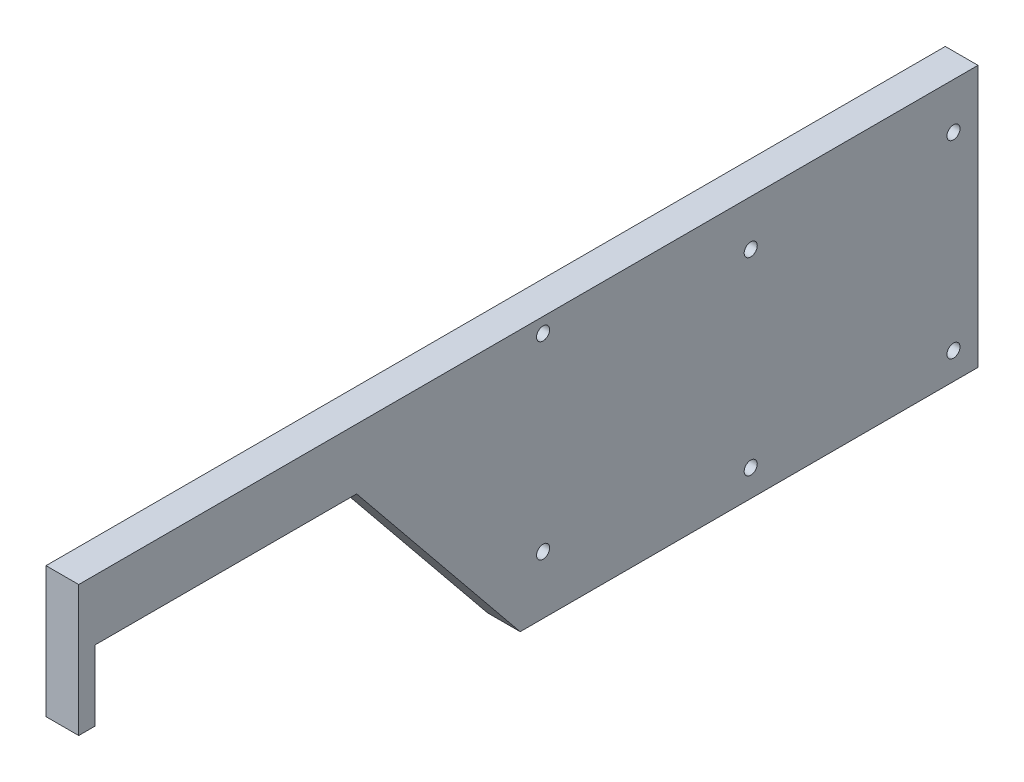
ISO-10303-21;
HEADER;
FILE_DESCRIPTION(('STEP AP214'),'2;1');
FILE_NAME('part.step','',(''),(''),'','','');
FILE_SCHEMA(('AUTOMOTIVE_DESIGN { 1 0 10303 214 1 1 1 1 }'));
ENDSEC;
DATA;
#1=APPLICATION_CONTEXT('core data for automotive mechanical design processes');
#2=APPLICATION_PROTOCOL_DEFINITION('international standard','automotive_design',2000,#1);
#3=PRODUCT_CONTEXT('',#1,'mechanical');
#4=PRODUCT('Part','Part','',(#3));
#5=PRODUCT_RELATED_PRODUCT_CATEGORY('part','',(#4));
#6=PRODUCT_DEFINITION_FORMATION('','',#4);
#7=PRODUCT_DEFINITION_CONTEXT('part definition',#1,'design');
#8=PRODUCT_DEFINITION('design','',#6,#7);
#9=PRODUCT_DEFINITION_SHAPE('','',#8);
#10=(LENGTH_UNIT() NAMED_UNIT(*) SI_UNIT(.MILLI.,.METRE.));
#11=(NAMED_UNIT(*) PLANE_ANGLE_UNIT() SI_UNIT($,.RADIAN.));
#12=(NAMED_UNIT(*) SI_UNIT($,.STERADIAN.) SOLID_ANGLE_UNIT());
#13=UNCERTAINTY_MEASURE_WITH_UNIT(LENGTH_MEASURE(1.E-05),#10,'distance_accuracy_value','');
#14=(GEOMETRIC_REPRESENTATION_CONTEXT(3) GLOBAL_UNCERTAINTY_ASSIGNED_CONTEXT((#13)) GLOBAL_UNIT_ASSIGNED_CONTEXT((#10,
#11,#12)) REPRESENTATION_CONTEXT('',''));
#15=CARTESIAN_POINT('',(0.,0.,0.));
#16=DIRECTION('',(0.,0.,1.));
#17=DIRECTION('',(1.,0.,0.));
#18=AXIS2_PLACEMENT_3D('',#15,#16,#17);
#19=CARTESIAN_POINT('',(10.,0.,0.));
#20=DIRECTION('',(-1.,0.,0.));
#21=DIRECTION('',(0.,0.,1.));
#22=AXIS2_PLACEMENT_3D('',#19,#20,#21);
#23=PLANE('',#22);
#24=DIRECTION('',(0.,0.,1.));
#25=VECTOR('',#24,1.);
#26=CARTESIAN_POINT('',(10.,29.25,43.));
#27=LINE('',#26,#25);
#28=CARTESIAN_POINT('',(10.,29.25,-232.));
#29=VERTEX_POINT('',#28);
#30=CARTESIAN_POINT('',(10.,29.25,43.));
#31=VERTEX_POINT('',#30);
#32=EDGE_CURVE('E168',#29,#31,#27,.T.);
#33=ORIENTED_EDGE('',*,*,#32,.T.);
#34=DIRECTION('',(0.,-1.,0.));
#35=VECTOR('',#34,1.);
#36=CARTESIAN_POINT('',(10.,-10.75,43.));
#37=LINE('',#36,#35);
#38=CARTESIAN_POINT('',(10.,-10.75,43.));
#39=VERTEX_POINT('',#38);
#40=EDGE_CURVE('E104',#31,#39,#37,.T.);
#41=ORIENTED_EDGE('',*,*,#40,.T.);
#42=DIRECTION('',(0.,0.,-1.));
#43=VECTOR('',#42,1.);
#44=CARTESIAN_POINT('',(10.,-10.75,38.));
#45=LINE('',#44,#43);
#46=CARTESIAN_POINT('',(10.,-10.75,38.));
#47=VERTEX_POINT('',#46);
#48=EDGE_CURVE('E189',#39,#47,#45,.T.);
#49=ORIENTED_EDGE('',*,*,#48,.T.);
#50=DIRECTION('',(0.,1.,0.));
#51=VECTOR('',#50,1.);
#52=CARTESIAN_POINT('',(10.,10.75,38.));
#53=LINE('',#52,#51);
#54=CARTESIAN_POINT('',(10.,10.75,38.));
#55=VERTEX_POINT('',#54);
#56=EDGE_CURVE('E203',#47,#55,#53,.T.);
#57=ORIENTED_EDGE('',*,*,#56,.T.);
#58=DIRECTION('',(0.,0.,-1.));
#59=VECTOR('',#58,1.);
#60=CARTESIAN_POINT('',(10.,10.75,-42.));
#61=LINE('',#60,#59);
#62=CARTESIAN_POINT('',(10.,10.75,-42.));
#63=VERTEX_POINT('',#62);
#64=EDGE_CURVE('E123',#55,#63,#61,.T.);
#65=ORIENTED_EDGE('',*,*,#64,.T.);
#66=DIRECTION('',(0.,-0.775921003990177,-0.63083008454486));
#67=VECTOR('',#66,1.);
#68=CARTESIAN_POINT('',(10.,-50.75,-92.));
#69=LINE('',#68,#67);
#70=CARTESIAN_POINT('',(10.,-50.75,-92.));
#71=VERTEX_POINT('',#70);
#72=EDGE_CURVE('E117',#63,#71,#69,.T.);
#73=ORIENTED_EDGE('',*,*,#72,.T.);
#74=DIRECTION('',(0.,0.,-1.));
#75=VECTOR('',#74,1.);
#76=CARTESIAN_POINT('',(10.,-50.75,-232.));
#77=LINE('',#76,#75);
#78=CARTESIAN_POINT('',(10.,-50.75,-232.));
#79=VERTEX_POINT('',#78);
#80=EDGE_CURVE('E121',#71,#79,#77,.T.);
#81=ORIENTED_EDGE('',*,*,#80,.T.);
#82=DIRECTION('',(0.,1.,0.));
#83=VECTOR('',#82,1.);
#84=CARTESIAN_POINT('',(10.,29.25,-232.));
#85=LINE('',#84,#83);
#86=EDGE_CURVE('E61',#79,#29,#85,.T.);
#87=ORIENTED_EDGE('',*,*,#86,.T.);
#88=EDGE_LOOP('',(#33,#41,#49,#57,#65,#73,#81,#87));
#89=FACE_BOUND('',#88,.T.);
#90=CARTESIAN_POINT('',(10.,24.75,-99.));
#91=DIRECTION('',(1.,0.,0.));
#92=DIRECTION('',(0.,0.,-1.));
#93=AXIS2_PLACEMENT_3D('',#90,#91,#92);
#94=CIRCLE('',#93,2.);
#95=CARTESIAN_POINT('',(10.,24.75,-101.));
#96=VERTEX_POINT('',#95);
#97=EDGE_CURVE('E150',#96,#96,#94,.T.);
#98=ORIENTED_EDGE('',*,*,#97,.F.);
#99=EDGE_LOOP('',(#98));
#100=FACE_BOUND('',#99,.T.);
#101=CARTESIAN_POINT('',(10.,-33.05,-99.));
#102=DIRECTION('',(1.,0.,0.));
#103=DIRECTION('',(0.,0.,-1.));
#104=AXIS2_PLACEMENT_3D('',#101,#102,#103);
#105=CIRCLE('',#104,2.);
#106=CARTESIAN_POINT('',(10.,-33.05,-101.));
#107=VERTEX_POINT('',#106);
#108=EDGE_CURVE('E217',#107,#107,#105,.T.);
#109=ORIENTED_EDGE('',*,*,#108,.F.);
#110=EDGE_LOOP('',(#109));
#111=FACE_BOUND('',#110,.T.);
#112=CARTESIAN_POINT('',(10.,15.25,-162.5));
#113=DIRECTION('',(1.,0.,0.));
#114=DIRECTION('',(0.,0.,-1.));
#115=AXIS2_PLACEMENT_3D('',#112,#113,#114);
#116=CIRCLE('',#115,2.);
#117=CARTESIAN_POINT('',(10.,15.25,-164.5));
#118=VERTEX_POINT('',#117);
#119=EDGE_CURVE('E225',#118,#118,#116,.T.);
#120=ORIENTED_EDGE('',*,*,#119,.F.);
#121=EDGE_LOOP('',(#120));
#122=FACE_BOUND('',#121,.T.);
#123=CARTESIAN_POINT('',(10.,15.25,-224.5));
#124=DIRECTION('',(1.,0.,0.));
#125=DIRECTION('',(0.,0.,-1.));
#126=AXIS2_PLACEMENT_3D('',#123,#124,#125);
#127=CIRCLE('',#126,2.);
#128=CARTESIAN_POINT('',(10.,15.25,-226.5));
#129=VERTEX_POINT('',#128);
#130=EDGE_CURVE('E233',#129,#129,#127,.T.);
#131=ORIENTED_EDGE('',*,*,#130,.F.);
#132=EDGE_LOOP('',(#131));
#133=FACE_BOUND('',#132,.T.);
#134=CARTESIAN_POINT('',(10.,-42.55,-162.5));
#135=DIRECTION('',(1.,0.,0.));
#136=DIRECTION('',(0.,0.,-1.));
#137=AXIS2_PLACEMENT_3D('',#134,#135,#136);
#138=CIRCLE('',#137,2.);
#139=CARTESIAN_POINT('',(10.,-42.55,-164.5));
#140=VERTEX_POINT('',#139);
#141=EDGE_CURVE('E241',#140,#140,#138,.T.);
#142=ORIENTED_EDGE('',*,*,#141,.F.);
#143=EDGE_LOOP('',(#142));
#144=FACE_BOUND('',#143,.T.);
#145=CARTESIAN_POINT('',(10.,-42.55,-224.5));
#146=DIRECTION('',(1.,0.,0.));
#147=DIRECTION('',(0.,0.,-1.));
#148=AXIS2_PLACEMENT_3D('',#145,#146,#147);
#149=CIRCLE('',#148,2.);
#150=CARTESIAN_POINT('',(10.,-42.55,-226.5));
#151=VERTEX_POINT('',#150);
#152=EDGE_CURVE('E249',#151,#151,#149,.T.);
#153=ORIENTED_EDGE('',*,*,#152,.F.);
#154=EDGE_LOOP('',(#153));
#155=FACE_BOUND('',#154,.T.);
#156=ADVANCED_FACE('F43',(#89,#100,#111,#122,#133,#144,#155),#23,.F.);
#157=CARTESIAN_POINT('',(0.,0.,0.));
#158=DIRECTION('',(-1.,0.,0.));
#159=DIRECTION('',(0.,0.,1.));
#160=AXIS2_PLACEMENT_3D('',#157,#158,#159);
#161=PLANE('',#160);
#162=CARTESIAN_POINT('',(0.,-42.55,-162.5));
#163=DIRECTION('',(1.,0.,0.));
#164=DIRECTION('',(0.,0.,-1.));
#165=AXIS2_PLACEMENT_3D('',#162,#163,#164);
#166=CIRCLE('',#165,2.);
#167=CARTESIAN_POINT('',(0.,-42.55,-164.5));
#168=VERTEX_POINT('',#167);
#169=EDGE_CURVE('E245',#168,#168,#166,.T.);
#170=ORIENTED_EDGE('',*,*,#169,.T.);
#171=EDGE_LOOP('',(#170));
#172=FACE_BOUND('',#171,.T.);
#173=CARTESIAN_POINT('',(0.,15.25,-162.5));
#174=DIRECTION('',(1.,0.,0.));
#175=DIRECTION('',(0.,0.,-1.));
#176=AXIS2_PLACEMENT_3D('',#173,#174,#175);
#177=CIRCLE('',#176,2.);
#178=CARTESIAN_POINT('',(0.,15.25,-164.5));
#179=VERTEX_POINT('',#178);
#180=EDGE_CURVE('E229',#179,#179,#177,.T.);
#181=ORIENTED_EDGE('',*,*,#180,.T.);
#182=EDGE_LOOP('',(#181));
#183=FACE_BOUND('',#182,.T.);
#184=CARTESIAN_POINT('',(0.,24.75,-99.));
#185=DIRECTION('',(1.,0.,0.));
#186=DIRECTION('',(0.,0.,-1.));
#187=AXIS2_PLACEMENT_3D('',#184,#185,#186);
#188=CIRCLE('',#187,2.);
#189=CARTESIAN_POINT('',(0.,24.75,-101.));
#190=VERTEX_POINT('',#189);
#191=EDGE_CURVE('E213',#190,#190,#188,.T.);
#192=ORIENTED_EDGE('',*,*,#191,.T.);
#193=EDGE_LOOP('',(#192));
#194=FACE_BOUND('',#193,.T.);
#195=DIRECTION('',(0.,0.,1.));
#196=VECTOR('',#195,1.);
#197=CARTESIAN_POINT('',(0.,29.25,43.));
#198=LINE('',#197,#196);
#199=CARTESIAN_POINT('',(0.,29.25,-232.));
#200=VERTEX_POINT('',#199);
#201=CARTESIAN_POINT('',(0.,29.25,43.));
#202=VERTEX_POINT('',#201);
#203=EDGE_CURVE('E145',#200,#202,#198,.T.);
#204=ORIENTED_EDGE('',*,*,#203,.F.);
#205=DIRECTION('',(0.,1.,0.));
#206=VECTOR('',#205,1.);
#207=CARTESIAN_POINT('',(0.,29.25,-232.));
#208=LINE('',#207,#206);
#209=CARTESIAN_POINT('',(0.,-50.75,-232.));
#210=VERTEX_POINT('',#209);
#211=EDGE_CURVE('E96',#210,#200,#208,.T.);
#212=ORIENTED_EDGE('',*,*,#211,.F.);
#213=DIRECTION('',(0.,0.,-1.));
#214=VECTOR('',#213,1.);
#215=CARTESIAN_POINT('',(0.,-50.75,-232.));
#216=LINE('',#215,#214);
#217=CARTESIAN_POINT('',(0.,-50.75,-92.));
#218=VERTEX_POINT('',#217);
#219=EDGE_CURVE('E90',#218,#210,#216,.T.);
#220=ORIENTED_EDGE('',*,*,#219,.F.);
#221=DIRECTION('',(0.,-0.775921003990177,-0.63083008454486));
#222=VECTOR('',#221,1.);
#223=CARTESIAN_POINT('',(0.,-50.75,-92.));
#224=LINE('',#223,#222);
#225=CARTESIAN_POINT('',(0.,10.75,-42.));
#226=VERTEX_POINT('',#225);
#227=EDGE_CURVE('E132',#226,#218,#224,.T.);
#228=ORIENTED_EDGE('',*,*,#227,.F.);
#229=DIRECTION('',(0.,0.,-1.));
#230=VECTOR('',#229,1.);
#231=CARTESIAN_POINT('',(0.,10.75,-42.));
#232=LINE('',#231,#230);
#233=CARTESIAN_POINT('',(0.,10.75,38.));
#234=VERTEX_POINT('',#233);
#235=EDGE_CURVE('E159',#234,#226,#232,.T.);
#236=ORIENTED_EDGE('',*,*,#235,.F.);
#237=DIRECTION('',(0.,1.,0.));
#238=VECTOR('',#237,1.);
#239=CARTESIAN_POINT('',(0.,10.75,38.));
#240=LINE('',#239,#238);
#241=CARTESIAN_POINT('',(0.,-10.75,38.));
#242=VERTEX_POINT('',#241);
#243=EDGE_CURVE('E156',#242,#234,#240,.T.);
#244=ORIENTED_EDGE('',*,*,#243,.F.);
#245=DIRECTION('',(0.,0.,-1.));
#246=VECTOR('',#245,1.);
#247=CARTESIAN_POINT('',(0.,-10.75,38.));
#248=LINE('',#247,#246);
#249=CARTESIAN_POINT('',(0.,-10.75,43.));
#250=VERTEX_POINT('',#249);
#251=EDGE_CURVE('E153',#250,#242,#248,.T.);
#252=ORIENTED_EDGE('',*,*,#251,.F.);
#253=DIRECTION('',(0.,-1.,0.));
#254=VECTOR('',#253,1.);
#255=CARTESIAN_POINT('',(0.,-10.75,43.));
#256=LINE('',#255,#254);
#257=EDGE_CURVE('E149',#202,#250,#256,.T.);
#258=ORIENTED_EDGE('',*,*,#257,.F.);
#259=EDGE_LOOP('',(#204,#212,#220,#228,#236,#244,#252,#258));
#260=FACE_BOUND('',#259,.T.);
#261=CARTESIAN_POINT('',(0.,-33.05,-99.));
#262=DIRECTION('',(1.,0.,0.));
#263=DIRECTION('',(0.,0.,-1.));
#264=AXIS2_PLACEMENT_3D('',#261,#262,#263);
#265=CIRCLE('',#264,2.);
#266=CARTESIAN_POINT('',(0.,-33.05,-101.));
#267=VERTEX_POINT('',#266);
#268=EDGE_CURVE('E221',#267,#267,#265,.T.);
#269=ORIENTED_EDGE('',*,*,#268,.T.);
#270=EDGE_LOOP('',(#269));
#271=FACE_BOUND('',#270,.T.);
#272=CARTESIAN_POINT('',(0.,15.25,-224.5));
#273=DIRECTION('',(1.,0.,0.));
#274=DIRECTION('',(0.,0.,-1.));
#275=AXIS2_PLACEMENT_3D('',#272,#273,#274);
#276=CIRCLE('',#275,2.);
#277=CARTESIAN_POINT('',(0.,15.25,-226.5));
#278=VERTEX_POINT('',#277);
#279=EDGE_CURVE('E237',#278,#278,#276,.T.);
#280=ORIENTED_EDGE('',*,*,#279,.T.);
#281=EDGE_LOOP('',(#280));
#282=FACE_BOUND('',#281,.T.);
#283=CARTESIAN_POINT('',(0.,-42.55,-224.5));
#284=DIRECTION('',(1.,0.,0.));
#285=DIRECTION('',(0.,0.,-1.));
#286=AXIS2_PLACEMENT_3D('',#283,#284,#285);
#287=CIRCLE('',#286,2.);
#288=CARTESIAN_POINT('',(0.,-42.55,-226.5));
#289=VERTEX_POINT('',#288);
#290=EDGE_CURVE('E253',#289,#289,#287,.T.);
#291=ORIENTED_EDGE('',*,*,#290,.T.);
#292=EDGE_LOOP('',(#291));
#293=FACE_BOUND('',#292,.T.);
#294=ADVANCED_FACE('F193',(#172,#183,#194,#260,#271,#282,#293),#161,.T.);
#295=CARTESIAN_POINT('',(10.,29.25,43.));
#296=DIRECTION('',(0.,-1.,0.));
#297=DIRECTION('',(0.,0.,-1.));
#298=AXIS2_PLACEMENT_3D('',#295,#296,#297);
#299=PLANE('',#298);
#300=ORIENTED_EDGE('',*,*,#203,.T.);
#301=DIRECTION('',(-1.,0.,0.));
#302=VECTOR('',#301,1.);
#303=CARTESIAN_POINT('',(10.,29.25,43.));
#304=LINE('',#303,#302);
#305=EDGE_CURVE('E11',#31,#202,#304,.T.);
#306=ORIENTED_EDGE('',*,*,#305,.F.);
#307=ORIENTED_EDGE('',*,*,#32,.F.);
#308=DIRECTION('',(-1.,0.,0.));
#309=VECTOR('',#308,1.);
#310=CARTESIAN_POINT('',(10.,29.25,-232.));
#311=LINE('',#310,#309);
#312=EDGE_CURVE('E141',#29,#200,#311,.T.);
#313=ORIENTED_EDGE('',*,*,#312,.T.);
#314=EDGE_LOOP('',(#300,#306,#307,#313));
#315=FACE_BOUND('',#314,.T.);
#316=ADVANCED_FACE('F45',(#315),#299,.F.);
#317=CARTESIAN_POINT('',(10.,-10.75,43.));
#318=DIRECTION('',(0.,0.,-1.));
#319=DIRECTION('',(-1.,0.,0.));
#320=AXIS2_PLACEMENT_3D('',#317,#318,#319);
#321=PLANE('',#320);
#322=ORIENTED_EDGE('',*,*,#257,.T.);
#323=DIRECTION('',(-1.,0.,0.));
#324=VECTOR('',#323,1.);
#325=CARTESIAN_POINT('',(10.,-10.75,43.));
#326=LINE('',#325,#324);
#327=EDGE_CURVE('E53',#39,#250,#326,.T.);
#328=ORIENTED_EDGE('',*,*,#327,.F.);
#329=ORIENTED_EDGE('',*,*,#40,.F.);
#330=ORIENTED_EDGE('',*,*,#305,.T.);
#331=EDGE_LOOP('',(#322,#328,#329,#330));
#332=FACE_BOUND('',#331,.T.);
#333=ADVANCED_FACE('F287',(#332),#321,.F.);
#334=CARTESIAN_POINT('',(10.,-10.75,38.));
#335=DIRECTION('',(0.,1.,0.));
#336=DIRECTION('',(0.,0.,1.));
#337=AXIS2_PLACEMENT_3D('',#334,#335,#336);
#338=PLANE('',#337);
#339=ORIENTED_EDGE('',*,*,#251,.T.);
#340=DIRECTION('',(-1.,0.,0.));
#341=VECTOR('',#340,1.);
#342=CARTESIAN_POINT('',(10.,-10.75,38.));
#343=LINE('',#342,#341);
#344=EDGE_CURVE('E179',#47,#242,#343,.T.);
#345=ORIENTED_EDGE('',*,*,#344,.F.);
#346=ORIENTED_EDGE('',*,*,#48,.F.);
#347=ORIENTED_EDGE('',*,*,#327,.T.);
#348=EDGE_LOOP('',(#339,#345,#346,#347));
#349=FACE_BOUND('',#348,.T.);
#350=ADVANCED_FACE('F187',(#349),#338,.F.);
#351=CARTESIAN_POINT('',(10.,10.75,38.));
#352=DIRECTION('',(0.,0.,1.));
#353=DIRECTION('',(1.,0.,0.));
#354=AXIS2_PLACEMENT_3D('',#351,#352,#353);
#355=PLANE('',#354);
#356=ORIENTED_EDGE('',*,*,#243,.T.);
#357=DIRECTION('',(-1.,0.,0.));
#358=VECTOR('',#357,1.);
#359=CARTESIAN_POINT('',(10.,10.75,38.));
#360=LINE('',#359,#358);
#361=EDGE_CURVE('E175',#55,#234,#360,.T.);
#362=ORIENTED_EDGE('',*,*,#361,.F.);
#363=ORIENTED_EDGE('',*,*,#56,.F.);
#364=ORIENTED_EDGE('',*,*,#344,.T.);
#365=EDGE_LOOP('',(#356,#362,#363,#364));
#366=FACE_BOUND('',#365,.T.);
#367=ADVANCED_FACE('F198',(#366),#355,.F.);
#368=CARTESIAN_POINT('',(10.,10.75,-42.));
#369=DIRECTION('',(0.,1.,0.));
#370=DIRECTION('',(0.,0.,1.));
#371=AXIS2_PLACEMENT_3D('',#368,#369,#370);
#372=PLANE('',#371);
#373=ORIENTED_EDGE('',*,*,#235,.T.);
#374=DIRECTION('',(-1.,0.,0.));
#375=VECTOR('',#374,1.);
#376=CARTESIAN_POINT('',(10.,10.75,-42.));
#377=LINE('',#376,#375);
#378=EDGE_CURVE('E134',#63,#226,#377,.T.);
#379=ORIENTED_EDGE('',*,*,#378,.F.);
#380=ORIENTED_EDGE('',*,*,#64,.F.);
#381=ORIENTED_EDGE('',*,*,#361,.T.);
#382=EDGE_LOOP('',(#373,#379,#380,#381));
#383=FACE_BOUND('',#382,.T.);
#384=ADVANCED_FACE('F201',(#383),#372,.F.);
#385=CARTESIAN_POINT('',(10.,-50.75,-92.));
#386=DIRECTION('',(0.,0.63083008454486,-0.775921003990178));
#387=DIRECTION('',(0.,0.775921003990178,0.63083008454486));
#388=AXIS2_PLACEMENT_3D('',#385,#386,#387);
#389=PLANE('',#388);
#390=ORIENTED_EDGE('',*,*,#227,.T.);
#391=DIRECTION('',(-1.,0.,0.));
#392=VECTOR('',#391,1.);
#393=CARTESIAN_POINT('',(10.,-50.75,-92.));
#394=LINE('',#393,#392);
#395=EDGE_CURVE('E129',#71,#218,#394,.T.);
#396=ORIENTED_EDGE('',*,*,#395,.F.);
#397=ORIENTED_EDGE('',*,*,#72,.F.);
#398=ORIENTED_EDGE('',*,*,#378,.T.);
#399=EDGE_LOOP('',(#390,#396,#397,#398));
#400=FACE_BOUND('',#399,.T.);
#401=ADVANCED_FACE('F130',(#400),#389,.F.);
#402=CARTESIAN_POINT('',(10.,-50.75,-232.));
#403=DIRECTION('',(0.,1.,0.));
#404=DIRECTION('',(0.,0.,1.));
#405=AXIS2_PLACEMENT_3D('',#402,#403,#404);
#406=PLANE('',#405);
#407=ORIENTED_EDGE('',*,*,#219,.T.);
#408=DIRECTION('',(-1.,0.,0.));
#409=VECTOR('',#408,1.);
#410=CARTESIAN_POINT('',(10.,-50.75,-232.));
#411=LINE('',#410,#409);
#412=EDGE_CURVE('E135',#79,#210,#411,.T.);
#413=ORIENTED_EDGE('',*,*,#412,.F.);
#414=ORIENTED_EDGE('',*,*,#80,.F.);
#415=ORIENTED_EDGE('',*,*,#395,.T.);
#416=EDGE_LOOP('',(#407,#413,#414,#415));
#417=FACE_BOUND('',#416,.T.);
#418=ADVANCED_FACE('F137',(#417),#406,.F.);
#419=CARTESIAN_POINT('',(10.,29.25,-232.));
#420=DIRECTION('',(0.,0.,1.));
#421=DIRECTION('',(1.,0.,0.));
#422=AXIS2_PLACEMENT_3D('',#419,#420,#421);
#423=PLANE('',#422);
#424=ORIENTED_EDGE('',*,*,#211,.T.);
#425=ORIENTED_EDGE('',*,*,#312,.F.);
#426=ORIENTED_EDGE('',*,*,#86,.F.);
#427=ORIENTED_EDGE('',*,*,#412,.T.);
#428=EDGE_LOOP('',(#424,#425,#426,#427));
#429=FACE_BOUND('',#428,.T.);
#430=ADVANCED_FACE('F275',(#429),#423,.F.);
#431=CARTESIAN_POINT('',(10.,24.75,-99.));
#432=DIRECTION('',(-1.,0.,0.));
#433=DIRECTION('',(0.,0.,1.));
#434=AXIS2_PLACEMENT_3D('',#431,#432,#433);
#435=CYLINDRICAL_SURFACE('',#434,2.);
#436=ORIENTED_EDGE('',*,*,#97,.T.);
#437=EDGE_LOOP('',(#436));
#438=FACE_BOUND('',#437,.T.);
#439=ORIENTED_EDGE('',*,*,#191,.F.);
#440=EDGE_LOOP('',(#439));
#441=FACE_BOUND('',#440,.T.);
#442=ADVANCED_FACE('F272',(#438,#441),#435,.F.);
#443=CARTESIAN_POINT('',(10.,-33.05,-99.));
#444=DIRECTION('',(-1.,0.,0.));
#445=DIRECTION('',(0.,0.,1.));
#446=AXIS2_PLACEMENT_3D('',#443,#444,#445);
#447=CYLINDRICAL_SURFACE('',#446,2.);
#448=ORIENTED_EDGE('',*,*,#108,.T.);
#449=EDGE_LOOP('',(#448));
#450=FACE_BOUND('',#449,.T.);
#451=ORIENTED_EDGE('',*,*,#268,.F.);
#452=EDGE_LOOP('',(#451));
#453=FACE_BOUND('',#452,.T.);
#454=ADVANCED_FACE('F363',(#450,#453),#447,.F.);
#455=CARTESIAN_POINT('',(10.,15.25,-162.5));
#456=DIRECTION('',(-1.,0.,0.));
#457=DIRECTION('',(0.,0.,1.));
#458=AXIS2_PLACEMENT_3D('',#455,#456,#457);
#459=CYLINDRICAL_SURFACE('',#458,2.);
#460=ORIENTED_EDGE('',*,*,#119,.T.);
#461=EDGE_LOOP('',(#460));
#462=FACE_BOUND('',#461,.T.);
#463=ORIENTED_EDGE('',*,*,#180,.F.);
#464=EDGE_LOOP('',(#463));
#465=FACE_BOUND('',#464,.T.);
#466=ADVANCED_FACE('F372',(#462,#465),#459,.F.);
#467=CARTESIAN_POINT('',(10.,15.25,-224.5));
#468=DIRECTION('',(-1.,0.,0.));
#469=DIRECTION('',(0.,0.,1.));
#470=AXIS2_PLACEMENT_3D('',#467,#468,#469);
#471=CYLINDRICAL_SURFACE('',#470,2.);
#472=ORIENTED_EDGE('',*,*,#130,.T.);
#473=EDGE_LOOP('',(#472));
#474=FACE_BOUND('',#473,.T.);
#475=ORIENTED_EDGE('',*,*,#279,.F.);
#476=EDGE_LOOP('',(#475));
#477=FACE_BOUND('',#476,.T.);
#478=ADVANCED_FACE('F381',(#474,#477),#471,.F.);
#479=CARTESIAN_POINT('',(10.,-42.55,-162.5));
#480=DIRECTION('',(-1.,0.,0.));
#481=DIRECTION('',(0.,0.,1.));
#482=AXIS2_PLACEMENT_3D('',#479,#480,#481);
#483=CYLINDRICAL_SURFACE('',#482,2.);
#484=ORIENTED_EDGE('',*,*,#141,.T.);
#485=EDGE_LOOP('',(#484));
#486=FACE_BOUND('',#485,.T.);
#487=ORIENTED_EDGE('',*,*,#169,.F.);
#488=EDGE_LOOP('',(#487));
#489=FACE_BOUND('',#488,.T.);
#490=ADVANCED_FACE('F391',(#486,#489),#483,.F.);
#491=CARTESIAN_POINT('',(10.,-42.55,-224.5));
#492=DIRECTION('',(-1.,0.,0.));
#493=DIRECTION('',(0.,0.,1.));
#494=AXIS2_PLACEMENT_3D('',#491,#492,#493);
#495=CYLINDRICAL_SURFACE('',#494,2.);
#496=ORIENTED_EDGE('',*,*,#152,.T.);
#497=EDGE_LOOP('',(#496));
#498=FACE_BOUND('',#497,.T.);
#499=ORIENTED_EDGE('',*,*,#290,.F.);
#500=EDGE_LOOP('',(#499));
#501=FACE_BOUND('',#500,.T.);
#502=ADVANCED_FACE('F261',(#498,#501),#495,.F.);
#503=CLOSED_SHELL('',(#156,#294,#316,#333,#350,#367,#384,#401,#418,#430,#442,#454,#466,#478,
#490,#502));
#504=MANIFOLD_SOLID_BREP('B2',#503);
#505=ADVANCED_BREP_SHAPE_REPRESENTATION('',(#18,#504),#14);
#506=SHAPE_DEFINITION_REPRESENTATION(#9,#505);
ENDSEC;
END-ISO-10303-21;
